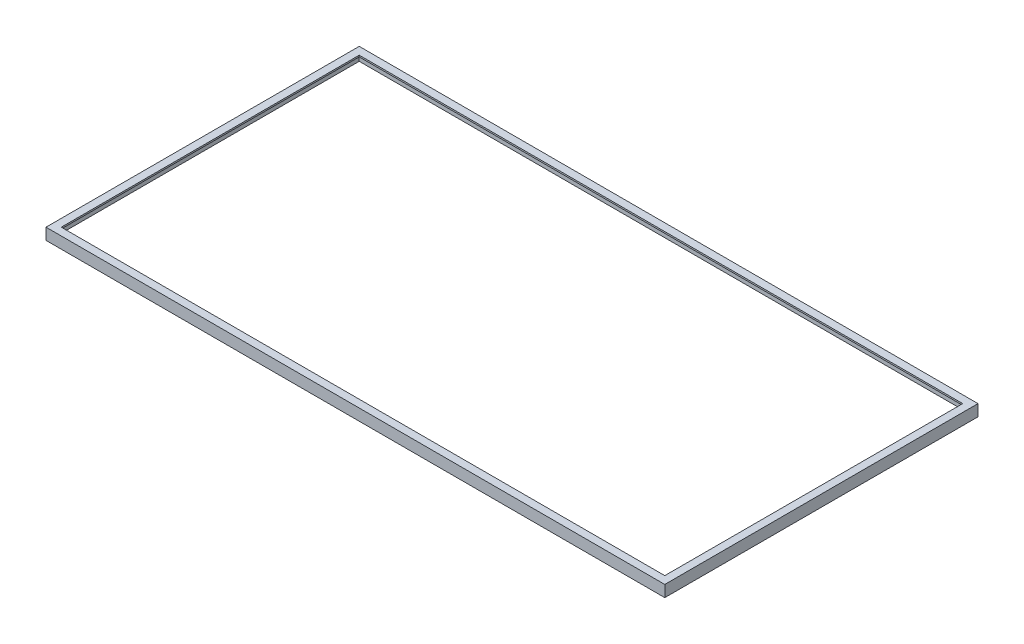
ISO-10303-21;
HEADER;
FILE_DESCRIPTION(('STEP AP214'),'2;1');
FILE_NAME('part.step','',(''),(''),'','','');
FILE_SCHEMA(('AUTOMOTIVE_DESIGN { 1 0 10303 214 1 1 1 1 }'));
ENDSEC;
DATA;
#1=APPLICATION_CONTEXT('core data for automotive mechanical design processes');
#2=APPLICATION_PROTOCOL_DEFINITION('international standard','automotive_design',2000,#1);
#3=PRODUCT_CONTEXT('',#1,'mechanical');
#4=PRODUCT('Part','Part','',(#3));
#5=PRODUCT_RELATED_PRODUCT_CATEGORY('part','',(#4));
#6=PRODUCT_DEFINITION_FORMATION('','',#4);
#7=PRODUCT_DEFINITION_CONTEXT('part definition',#1,'design');
#8=PRODUCT_DEFINITION('design','',#6,#7);
#9=PRODUCT_DEFINITION_SHAPE('','',#8);
#10=(LENGTH_UNIT() NAMED_UNIT(*) SI_UNIT(.MILLI.,.METRE.));
#11=(NAMED_UNIT(*) PLANE_ANGLE_UNIT() SI_UNIT($,.RADIAN.));
#12=(NAMED_UNIT(*) SI_UNIT($,.STERADIAN.) SOLID_ANGLE_UNIT());
#13=UNCERTAINTY_MEASURE_WITH_UNIT(LENGTH_MEASURE(1.E-05),#10,'distance_accuracy_value','');
#14=(GEOMETRIC_REPRESENTATION_CONTEXT(3) GLOBAL_UNCERTAINTY_ASSIGNED_CONTEXT((#13)) GLOBAL_UNIT_ASSIGNED_CONTEXT((#10,
#11,#12)) REPRESENTATION_CONTEXT('',''));
#15=CARTESIAN_POINT('',(0.,0.,0.));
#16=DIRECTION('',(0.,0.,1.));
#17=DIRECTION('',(1.,0.,0.));
#18=AXIS2_PLACEMENT_3D('',#15,#16,#17);
#19=CARTESIAN_POINT('',(0.,0.,0.));
#20=DIRECTION('',(0.,-1.,0.));
#21=DIRECTION('',(0.,0.,-1.));
#22=AXIS2_PLACEMENT_3D('',#19,#20,#21);
#23=PLANE('',#22);
#24=DIRECTION('',(0.,0.,1.));
#25=VECTOR('',#24,1.);
#26=CARTESIAN_POINT('',(0.,0.,0.));
#27=LINE('',#26,#25);
#28=CARTESIAN_POINT('',(0.,0.,-410.));
#29=VERTEX_POINT('',#28);
#30=CARTESIAN_POINT('',(0.,0.,0.));
#31=VERTEX_POINT('',#30);
#32=EDGE_CURVE('E155',#29,#31,#27,.T.);
#33=ORIENTED_EDGE('',*,*,#32,.F.);
#34=DIRECTION('',(-1.,0.,0.));
#35=VECTOR('',#34,1.);
#36=CARTESIAN_POINT('',(0.,0.,-410.));
#37=LINE('',#36,#35);
#38=CARTESIAN_POINT('',(810.,0.,-410.));
#39=VERTEX_POINT('',#38);
#40=EDGE_CURVE('E187',#39,#29,#37,.T.);
#41=ORIENTED_EDGE('',*,*,#40,.F.);
#42=DIRECTION('',(0.,0.,-1.));
#43=VECTOR('',#42,1.);
#44=CARTESIAN_POINT('',(810.,0.,0.));
#45=LINE('',#44,#43);
#46=CARTESIAN_POINT('',(810.,0.,0.));
#47=VERTEX_POINT('',#46);
#48=EDGE_CURVE('E198',#47,#39,#45,.T.);
#49=ORIENTED_EDGE('',*,*,#48,.F.);
#50=DIRECTION('',(1.,0.,0.));
#51=VECTOR('',#50,1.);
#52=CARTESIAN_POINT('',(0.,0.,0.));
#53=LINE('',#52,#51);
#54=EDGE_CURVE('E196',#31,#47,#53,.T.);
#55=ORIENTED_EDGE('',*,*,#54,.F.);
#56=EDGE_LOOP('',(#33,#41,#49,#55));
#57=FACE_BOUND('',#56,.T.);
#58=DIRECTION('',(-1.,0.,0.));
#59=VECTOR('',#58,1.);
#60=CARTESIAN_POINT('',(0.,0.,-408.));
#61=LINE('',#60,#59);
#62=CARTESIAN_POINT('',(808.,0.,-408.));
#63=VERTEX_POINT('',#62);
#64=CARTESIAN_POINT('',(2.,0.,-408.));
#65=VERTEX_POINT('',#64);
#66=EDGE_CURVE('E161',#63,#65,#61,.T.);
#67=ORIENTED_EDGE('',*,*,#66,.T.);
#68=DIRECTION('',(0.,0.,1.));
#69=VECTOR('',#68,1.);
#70=CARTESIAN_POINT('',(2.,0.,0.));
#71=LINE('',#70,#69);
#72=CARTESIAN_POINT('',(2.,0.,-2.));
#73=VERTEX_POINT('',#72);
#74=EDGE_CURVE('E149',#65,#73,#71,.T.);
#75=ORIENTED_EDGE('',*,*,#74,.T.);
#76=DIRECTION('',(1.,0.,0.));
#77=VECTOR('',#76,1.);
#78=CARTESIAN_POINT('',(0.,0.,-2.));
#79=LINE('',#78,#77);
#80=CARTESIAN_POINT('',(808.,0.,-2.));
#81=VERTEX_POINT('',#80);
#82=EDGE_CURVE('E175',#73,#81,#79,.T.);
#83=ORIENTED_EDGE('',*,*,#82,.T.);
#84=DIRECTION('',(0.,0.,-1.));
#85=VECTOR('',#84,1.);
#86=CARTESIAN_POINT('',(808.,0.,0.));
#87=LINE('',#86,#85);
#88=EDGE_CURVE('E178',#81,#63,#87,.T.);
#89=ORIENTED_EDGE('',*,*,#88,.T.);
#90=EDGE_LOOP('',(#67,#75,#83,#89));
#91=FACE_BOUND('',#90,.T.);
#92=ADVANCED_FACE('F35',(#57,#91),#23,.T.);
#93=CARTESIAN_POINT('',(0.,15.,0.));
#94=DIRECTION('',(1.,0.,0.));
#95=DIRECTION('',(0.,0.,-1.));
#96=AXIS2_PLACEMENT_3D('',#93,#94,#95);
#97=PLANE('',#96);
#98=ORIENTED_EDGE('',*,*,#32,.T.);
#99=DIRECTION('',(0.,-1.,0.));
#100=VECTOR('',#99,1.);
#101=CARTESIAN_POINT('',(0.,15.,0.));
#102=LINE('',#101,#100);
#103=CARTESIAN_POINT('',(0.,15.,0.));
#104=VERTEX_POINT('',#103);
#105=EDGE_CURVE('E209',#104,#31,#102,.T.);
#106=ORIENTED_EDGE('',*,*,#105,.F.);
#107=DIRECTION('',(0.,0.,1.));
#108=VECTOR('',#107,1.);
#109=CARTESIAN_POINT('',(0.,15.,0.));
#110=LINE('',#109,#108);
#111=CARTESIAN_POINT('',(0.,15.,-410.));
#112=VERTEX_POINT('',#111);
#113=EDGE_CURVE('E183',#112,#104,#110,.T.);
#114=ORIENTED_EDGE('',*,*,#113,.F.);
#115=DIRECTION('',(0.,-1.,0.));
#116=VECTOR('',#115,1.);
#117=CARTESIAN_POINT('',(0.,15.,-410.));
#118=LINE('',#117,#116);
#119=EDGE_CURVE('E193',#112,#29,#118,.T.);
#120=ORIENTED_EDGE('',*,*,#119,.T.);
#121=EDGE_LOOP('',(#98,#106,#114,#120));
#122=FACE_BOUND('',#121,.T.);
#123=ADVANCED_FACE('F37',(#122),#97,.F.);
#124=CARTESIAN_POINT('',(0.,15.,0.));
#125=DIRECTION('',(0.,0.,-1.));
#126=DIRECTION('',(-1.,0.,0.));
#127=AXIS2_PLACEMENT_3D('',#124,#125,#126);
#128=PLANE('',#127);
#129=ORIENTED_EDGE('',*,*,#54,.T.);
#130=DIRECTION('',(0.,-1.,0.));
#131=VECTOR('',#130,1.);
#132=CARTESIAN_POINT('',(810.,15.,0.));
#133=LINE('',#132,#131);
#134=CARTESIAN_POINT('',(810.,15.,0.));
#135=VERTEX_POINT('',#134);
#136=EDGE_CURVE('E206',#135,#47,#133,.T.);
#137=ORIENTED_EDGE('',*,*,#136,.F.);
#138=DIRECTION('',(1.,0.,0.));
#139=VECTOR('',#138,1.);
#140=CARTESIAN_POINT('',(0.,15.,0.));
#141=LINE('',#140,#139);
#142=EDGE_CURVE('E186',#104,#135,#141,.T.);
#143=ORIENTED_EDGE('',*,*,#142,.F.);
#144=ORIENTED_EDGE('',*,*,#105,.T.);
#145=EDGE_LOOP('',(#129,#137,#143,#144));
#146=FACE_BOUND('',#145,.T.);
#147=ADVANCED_FACE('F240',(#146),#128,.F.);
#148=CARTESIAN_POINT('',(810.,15.,0.));
#149=DIRECTION('',(-1.,0.,0.));
#150=DIRECTION('',(0.,0.,1.));
#151=AXIS2_PLACEMENT_3D('',#148,#149,#150);
#152=PLANE('',#151);
#153=ORIENTED_EDGE('',*,*,#48,.T.);
#154=DIRECTION('',(0.,-1.,0.));
#155=VECTOR('',#154,1.);
#156=CARTESIAN_POINT('',(810.,15.,-410.));
#157=LINE('',#156,#155);
#158=CARTESIAN_POINT('',(810.,15.,-410.));
#159=VERTEX_POINT('',#158);
#160=EDGE_CURVE('E203',#159,#39,#157,.T.);
#161=ORIENTED_EDGE('',*,*,#160,.F.);
#162=DIRECTION('',(0.,0.,-1.));
#163=VECTOR('',#162,1.);
#164=CARTESIAN_POINT('',(810.,15.,0.));
#165=LINE('',#164,#163);
#166=EDGE_CURVE('E189',#135,#159,#165,.T.);
#167=ORIENTED_EDGE('',*,*,#166,.F.);
#168=ORIENTED_EDGE('',*,*,#136,.T.);
#169=EDGE_LOOP('',(#153,#161,#167,#168));
#170=FACE_BOUND('',#169,.T.);
#171=ADVANCED_FACE('F249',(#170),#152,.F.);
#172=CARTESIAN_POINT('',(0.,15.,-410.));
#173=DIRECTION('',(0.,0.,1.));
#174=DIRECTION('',(1.,0.,0.));
#175=AXIS2_PLACEMENT_3D('',#172,#173,#174);
#176=PLANE('',#175);
#177=ORIENTED_EDGE('',*,*,#40,.T.);
#178=ORIENTED_EDGE('',*,*,#119,.F.);
#179=DIRECTION('',(-1.,0.,0.));
#180=VECTOR('',#179,1.);
#181=CARTESIAN_POINT('',(0.,15.,-410.));
#182=LINE('',#181,#180);
#183=EDGE_CURVE('E191',#159,#112,#182,.T.);
#184=ORIENTED_EDGE('',*,*,#183,.F.);
#185=ORIENTED_EDGE('',*,*,#160,.T.);
#186=EDGE_LOOP('',(#177,#178,#184,#185));
#187=FACE_BOUND('',#186,.T.);
#188=ADVANCED_FACE('F246',(#187),#176,.F.);
#189=CARTESIAN_POINT('',(0.,15.,0.));
#190=DIRECTION('',(0.,-1.,0.));
#191=DIRECTION('',(0.,0.,-1.));
#192=AXIS2_PLACEMENT_3D('',#189,#190,#191);
#193=PLANE('',#192);
#194=DIRECTION('',(1.,0.,0.));
#195=VECTOR('',#194,1.);
#196=CARTESIAN_POINT('',(10.,15.,-10.));
#197=LINE('',#196,#195);
#198=CARTESIAN_POINT('',(10.,15.,-10.));
#199=VERTEX_POINT('',#198);
#200=CARTESIAN_POINT('',(800.,15.,-10.));
#201=VERTEX_POINT('',#200);
#202=EDGE_CURVE('E135',#199,#201,#197,.T.);
#203=ORIENTED_EDGE('',*,*,#202,.F.);
#204=DIRECTION('',(0.,0.,1.));
#205=VECTOR('',#204,1.);
#206=CARTESIAN_POINT('',(10.,15.,-400.));
#207=LINE('',#206,#205);
#208=CARTESIAN_POINT('',(10.,15.,-400.));
#209=VERTEX_POINT('',#208);
#210=EDGE_CURVE('E50',#209,#199,#207,.T.);
#211=ORIENTED_EDGE('',*,*,#210,.F.);
#212=DIRECTION('',(-1.,0.,0.));
#213=VECTOR('',#212,1.);
#214=CARTESIAN_POINT('',(10.,15.,-400.));
#215=LINE('',#214,#213);
#216=CARTESIAN_POINT('',(800.,15.,-400.));
#217=VERTEX_POINT('',#216);
#218=EDGE_CURVE('E142',#217,#209,#215,.T.);
#219=ORIENTED_EDGE('',*,*,#218,.F.);
#220=DIRECTION('',(0.,0.,-1.));
#221=VECTOR('',#220,1.);
#222=CARTESIAN_POINT('',(800.,15.,-400.));
#223=LINE('',#222,#221);
#224=EDGE_CURVE('E126',#201,#217,#223,.T.);
#225=ORIENTED_EDGE('',*,*,#224,.F.);
#226=EDGE_LOOP('',(#203,#211,#219,#225));
#227=FACE_BOUND('',#226,.T.);
#228=ORIENTED_EDGE('',*,*,#113,.T.);
#229=ORIENTED_EDGE('',*,*,#142,.T.);
#230=ORIENTED_EDGE('',*,*,#166,.T.);
#231=ORIENTED_EDGE('',*,*,#183,.T.);
#232=EDGE_LOOP('',(#228,#229,#230,#231));
#233=FACE_BOUND('',#232,.T.);
#234=ADVANCED_FACE('F139',(#227,#233),#193,.F.);
#235=CARTESIAN_POINT('',(2.,15.,0.));
#236=DIRECTION('',(1.,0.,0.));
#237=DIRECTION('',(0.,0.,-1.));
#238=AXIS2_PLACEMENT_3D('',#235,#236,#237);
#239=PLANE('',#238);
#240=ORIENTED_EDGE('',*,*,#74,.F.);
#241=DIRECTION('',(0.,-1.,0.));
#242=VECTOR('',#241,1.);
#243=CARTESIAN_POINT('',(2.,15.,-408.));
#244=LINE('',#243,#242);
#245=CARTESIAN_POINT('',(2.,13.,-408.));
#246=VERTEX_POINT('',#245);
#247=EDGE_CURVE('E162',#246,#65,#244,.T.);
#248=ORIENTED_EDGE('',*,*,#247,.F.);
#249=DIRECTION('',(0.,0.,1.));
#250=VECTOR('',#249,1.);
#251=CARTESIAN_POINT('',(2.,13.,0.));
#252=LINE('',#251,#250);
#253=CARTESIAN_POINT('',(2.,13.,-2.));
#254=VERTEX_POINT('',#253);
#255=EDGE_CURVE('E157',#246,#254,#252,.T.);
#256=ORIENTED_EDGE('',*,*,#255,.T.);
#257=DIRECTION('',(0.,-1.,0.));
#258=VECTOR('',#257,1.);
#259=CARTESIAN_POINT('',(2.,15.,-2.));
#260=LINE('',#259,#258);
#261=EDGE_CURVE('E152',#254,#73,#260,.T.);
#262=ORIENTED_EDGE('',*,*,#261,.T.);
#263=EDGE_LOOP('',(#240,#248,#256,#262));
#264=FACE_BOUND('',#263,.T.);
#265=ADVANCED_FACE('F267',(#264),#239,.T.);
#266=CARTESIAN_POINT('',(0.,15.,-2.));
#267=DIRECTION('',(0.,0.,-1.));
#268=DIRECTION('',(-1.,0.,0.));
#269=AXIS2_PLACEMENT_3D('',#266,#267,#268);
#270=PLANE('',#269);
#271=ORIENTED_EDGE('',*,*,#82,.F.);
#272=ORIENTED_EDGE('',*,*,#261,.F.);
#273=DIRECTION('',(1.,0.,0.));
#274=VECTOR('',#273,1.);
#275=CARTESIAN_POINT('',(0.,13.,-2.));
#276=LINE('',#275,#274);
#277=CARTESIAN_POINT('',(808.,13.,-2.));
#278=VERTEX_POINT('',#277);
#279=EDGE_CURVE('E160',#254,#278,#276,.T.);
#280=ORIENTED_EDGE('',*,*,#279,.T.);
#281=DIRECTION('',(0.,-1.,0.));
#282=VECTOR('',#281,1.);
#283=CARTESIAN_POINT('',(808.,15.,-2.));
#284=LINE('',#283,#282);
#285=EDGE_CURVE('E156',#278,#81,#284,.T.);
#286=ORIENTED_EDGE('',*,*,#285,.T.);
#287=EDGE_LOOP('',(#271,#272,#280,#286));
#288=FACE_BOUND('',#287,.T.);
#289=ADVANCED_FACE('F271',(#288),#270,.T.);
#290=CARTESIAN_POINT('',(808.,15.,0.));
#291=DIRECTION('',(-1.,0.,0.));
#292=DIRECTION('',(0.,0.,1.));
#293=AXIS2_PLACEMENT_3D('',#290,#291,#292);
#294=PLANE('',#293);
#295=ORIENTED_EDGE('',*,*,#88,.F.);
#296=ORIENTED_EDGE('',*,*,#285,.F.);
#297=DIRECTION('',(0.,0.,-1.));
#298=VECTOR('',#297,1.);
#299=CARTESIAN_POINT('',(808.,13.,0.));
#300=LINE('',#299,#298);
#301=CARTESIAN_POINT('',(808.,13.,-408.));
#302=VERTEX_POINT('',#301);
#303=EDGE_CURVE('E169',#278,#302,#300,.T.);
#304=ORIENTED_EDGE('',*,*,#303,.T.);
#305=DIRECTION('',(0.,-1.,0.));
#306=VECTOR('',#305,1.);
#307=CARTESIAN_POINT('',(808.,15.,-408.));
#308=LINE('',#307,#306);
#309=EDGE_CURVE('E164',#302,#63,#308,.T.);
#310=ORIENTED_EDGE('',*,*,#309,.T.);
#311=EDGE_LOOP('',(#295,#296,#304,#310));
#312=FACE_BOUND('',#311,.T.);
#313=ADVANCED_FACE('F276',(#312),#294,.T.);
#314=CARTESIAN_POINT('',(0.,15.,-408.));
#315=DIRECTION('',(0.,0.,1.));
#316=DIRECTION('',(1.,0.,0.));
#317=AXIS2_PLACEMENT_3D('',#314,#315,#316);
#318=PLANE('',#317);
#319=ORIENTED_EDGE('',*,*,#66,.F.);
#320=ORIENTED_EDGE('',*,*,#309,.F.);
#321=DIRECTION('',(-1.,0.,0.));
#322=VECTOR('',#321,1.);
#323=CARTESIAN_POINT('',(0.,13.,-408.));
#324=LINE('',#323,#322);
#325=EDGE_CURVE('E165',#302,#246,#324,.T.);
#326=ORIENTED_EDGE('',*,*,#325,.T.);
#327=ORIENTED_EDGE('',*,*,#247,.T.);
#328=EDGE_LOOP('',(#319,#320,#326,#327));
#329=FACE_BOUND('',#328,.T.);
#330=ADVANCED_FACE('F230',(#329),#318,.T.);
#331=CARTESIAN_POINT('',(0.,13.,0.));
#332=DIRECTION('',(0.,-1.,0.));
#333=DIRECTION('',(0.,0.,-1.));
#334=AXIS2_PLACEMENT_3D('',#331,#332,#333);
#335=PLANE('',#334);
#336=DIRECTION('',(0.,0.,-1.));
#337=VECTOR('',#336,1.);
#338=CARTESIAN_POINT('',(10.,13.,0.));
#339=LINE('',#338,#337);
#340=CARTESIAN_POINT('',(10.,13.,-10.));
#341=VERTEX_POINT('',#340);
#342=CARTESIAN_POINT('',(10.,13.,-400.));
#343=VERTEX_POINT('',#342);
#344=EDGE_CURVE('E11',#341,#343,#339,.T.);
#345=ORIENTED_EDGE('',*,*,#344,.F.);
#346=DIRECTION('',(-1.,0.,0.));
#347=VECTOR('',#346,1.);
#348=CARTESIAN_POINT('',(0.,13.,-10.));
#349=LINE('',#348,#347);
#350=CARTESIAN_POINT('',(800.,13.,-10.));
#351=VERTEX_POINT('',#350);
#352=EDGE_CURVE('E212',#351,#341,#349,.T.);
#353=ORIENTED_EDGE('',*,*,#352,.F.);
#354=DIRECTION('',(0.,0.,1.));
#355=VECTOR('',#354,1.);
#356=CARTESIAN_POINT('',(800.,13.,-2.27738056333365E-13));
#357=LINE('',#356,#355);
#358=CARTESIAN_POINT('',(800.,13.,-400.));
#359=VERTEX_POINT('',#358);
#360=EDGE_CURVE('E129',#359,#351,#357,.T.);
#361=ORIENTED_EDGE('',*,*,#360,.F.);
#362=DIRECTION('',(1.,0.,0.));
#363=VECTOR('',#362,1.);
#364=CARTESIAN_POINT('',(0.,13.,-400.));
#365=LINE('',#364,#363);
#366=EDGE_CURVE('E43',#343,#359,#365,.T.);
#367=ORIENTED_EDGE('',*,*,#366,.F.);
#368=EDGE_LOOP('',(#345,#353,#361,#367));
#369=FACE_BOUND('',#368,.T.);
#370=ORIENTED_EDGE('',*,*,#255,.F.);
#371=ORIENTED_EDGE('',*,*,#325,.F.);
#372=ORIENTED_EDGE('',*,*,#303,.F.);
#373=ORIENTED_EDGE('',*,*,#279,.F.);
#374=EDGE_LOOP('',(#370,#371,#372,#373));
#375=FACE_BOUND('',#374,.T.);
#376=ADVANCED_FACE('F220',(#369,#375),#335,.T.);
#377=CARTESIAN_POINT('',(10.,0.,-400.));
#378=DIRECTION('',(-1.,0.,0.));
#379=DIRECTION('',(0.,0.,1.));
#380=AXIS2_PLACEMENT_3D('',#377,#378,#379);
#381=PLANE('',#380);
#382=ORIENTED_EDGE('',*,*,#344,.T.);
#383=DIRECTION('',(0.,1.,0.));
#384=VECTOR('',#383,1.);
#385=CARTESIAN_POINT('',(10.,0.,-400.));
#386=LINE('',#385,#384);
#387=EDGE_CURVE('E147',#343,#209,#386,.T.);
#388=ORIENTED_EDGE('',*,*,#387,.T.);
#389=ORIENTED_EDGE('',*,*,#210,.T.);
#390=DIRECTION('',(0.,1.,0.));
#391=VECTOR('',#390,1.);
#392=CARTESIAN_POINT('',(10.,0.,-10.));
#393=LINE('',#392,#391);
#394=EDGE_CURVE('E132',#341,#199,#393,.T.);
#395=ORIENTED_EDGE('',*,*,#394,.F.);
#396=EDGE_LOOP('',(#382,#388,#389,#395));
#397=FACE_BOUND('',#396,.T.);
#398=ADVANCED_FACE('F222',(#397),#381,.F.);
#399=CARTESIAN_POINT('',(10.,0.,-400.));
#400=DIRECTION('',(0.,0.,-1.));
#401=DIRECTION('',(-1.,0.,0.));
#402=AXIS2_PLACEMENT_3D('',#399,#400,#401);
#403=PLANE('',#402);
#404=ORIENTED_EDGE('',*,*,#366,.T.);
#405=DIRECTION('',(0.,1.,0.));
#406=VECTOR('',#405,1.);
#407=CARTESIAN_POINT('',(800.,0.,-400.));
#408=LINE('',#407,#406);
#409=EDGE_CURVE('E131',#359,#217,#408,.T.);
#410=ORIENTED_EDGE('',*,*,#409,.T.);
#411=ORIENTED_EDGE('',*,*,#218,.T.);
#412=ORIENTED_EDGE('',*,*,#387,.F.);
#413=EDGE_LOOP('',(#404,#410,#411,#412));
#414=FACE_BOUND('',#413,.T.);
#415=ADVANCED_FACE('F217',(#414),#403,.F.);
#416=CARTESIAN_POINT('',(800.,0.,-400.));
#417=DIRECTION('',(1.,0.,0.));
#418=DIRECTION('',(0.,0.,-1.));
#419=AXIS2_PLACEMENT_3D('',#416,#417,#418);
#420=PLANE('',#419);
#421=ORIENTED_EDGE('',*,*,#360,.T.);
#422=DIRECTION('',(0.,1.,0.));
#423=VECTOR('',#422,1.);
#424=CARTESIAN_POINT('',(800.,0.,-10.));
#425=LINE('',#424,#423);
#426=EDGE_CURVE('E58',#351,#201,#425,.T.);
#427=ORIENTED_EDGE('',*,*,#426,.T.);
#428=ORIENTED_EDGE('',*,*,#224,.T.);
#429=ORIENTED_EDGE('',*,*,#409,.F.);
#430=EDGE_LOOP('',(#421,#427,#428,#429));
#431=FACE_BOUND('',#430,.T.);
#432=ADVANCED_FACE('F123',(#431),#420,.F.);
#433=CARTESIAN_POINT('',(10.,0.,-10.));
#434=DIRECTION('',(0.,0.,1.));
#435=DIRECTION('',(1.,0.,0.));
#436=AXIS2_PLACEMENT_3D('',#433,#434,#435);
#437=PLANE('',#436);
#438=ORIENTED_EDGE('',*,*,#352,.T.);
#439=ORIENTED_EDGE('',*,*,#394,.T.);
#440=ORIENTED_EDGE('',*,*,#202,.T.);
#441=ORIENTED_EDGE('',*,*,#426,.F.);
#442=EDGE_LOOP('',(#438,#439,#440,#441));
#443=FACE_BOUND('',#442,.T.);
#444=ADVANCED_FACE('F136',(#443),#437,.F.);
#445=CLOSED_SHELL('',(#92,#123,#147,#171,#188,#234,#265,#289,#313,#330,#376,#398,#415,#432,#444));
#446=MANIFOLD_SOLID_BREP('B2',#445);
#447=ADVANCED_BREP_SHAPE_REPRESENTATION('',(#18,#446),#14);
#448=SHAPE_DEFINITION_REPRESENTATION(#9,#447);
ENDSEC;
END-ISO-10303-21;
